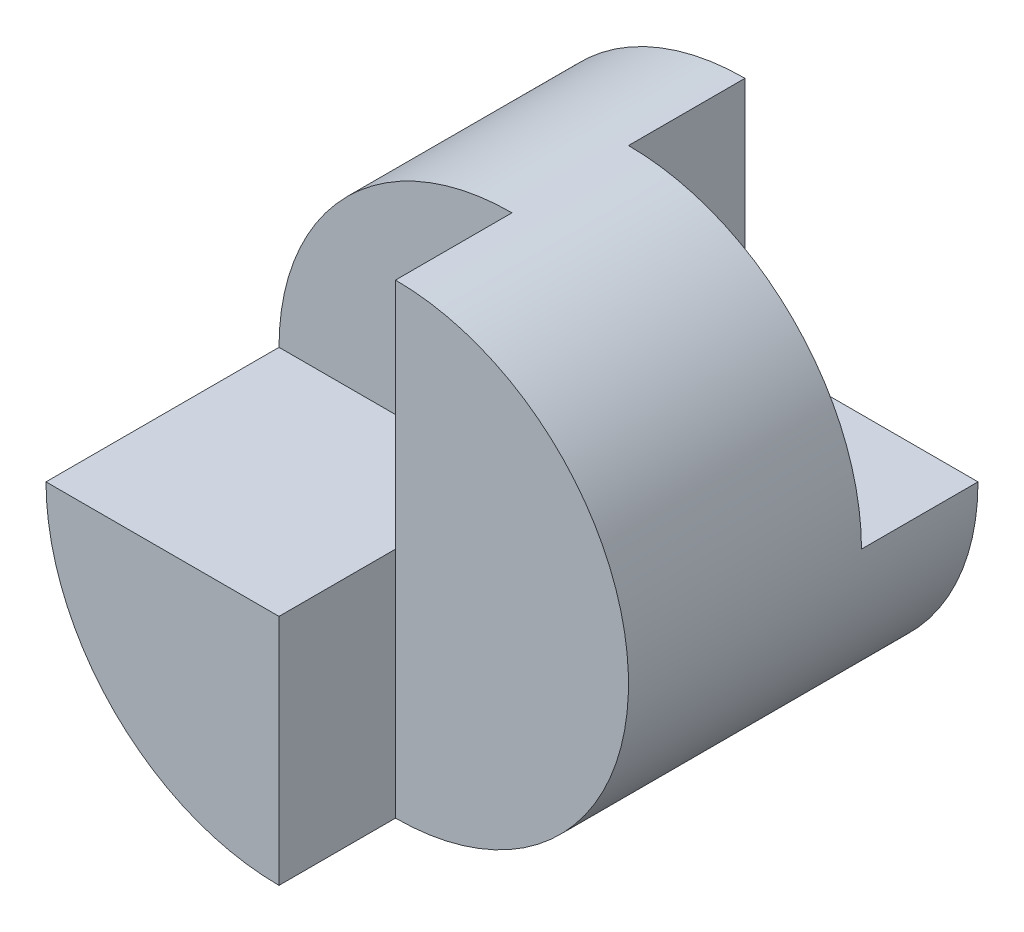
ISO-10303-21;
HEADER;
FILE_DESCRIPTION(('STEP AP214'),'2;1');
FILE_NAME('part.step','',(''),(''),'','','');
FILE_SCHEMA(('AUTOMOTIVE_DESIGN { 1 0 10303 214 1 1 1 1 }'));
ENDSEC;
DATA;
#1=APPLICATION_CONTEXT('core data for automotive mechanical design processes');
#2=APPLICATION_PROTOCOL_DEFINITION('international standard','automotive_design',2000,#1);
#3=PRODUCT_CONTEXT('',#1,'mechanical');
#4=PRODUCT('Part','Part','',(#3));
#5=PRODUCT_RELATED_PRODUCT_CATEGORY('part','',(#4));
#6=PRODUCT_DEFINITION_FORMATION('','',#4);
#7=PRODUCT_DEFINITION_CONTEXT('part definition',#1,'design');
#8=PRODUCT_DEFINITION('design','',#6,#7);
#9=PRODUCT_DEFINITION_SHAPE('','',#8);
#10=(LENGTH_UNIT() NAMED_UNIT(*) SI_UNIT(.MILLI.,.METRE.));
#11=(NAMED_UNIT(*) PLANE_ANGLE_UNIT() SI_UNIT($,.RADIAN.));
#12=(NAMED_UNIT(*) SI_UNIT($,.STERADIAN.) SOLID_ANGLE_UNIT());
#13=UNCERTAINTY_MEASURE_WITH_UNIT(LENGTH_MEASURE(1.E-05),#10,'distance_accuracy_value','');
#14=(GEOMETRIC_REPRESENTATION_CONTEXT(3) GLOBAL_UNCERTAINTY_ASSIGNED_CONTEXT((#13)) GLOBAL_UNIT_ASSIGNED_CONTEXT((#10,
#11,#12)) REPRESENTATION_CONTEXT('',''));
#15=CARTESIAN_POINT('',(0.,0.,0.));
#16=DIRECTION('',(0.,0.,1.));
#17=DIRECTION('',(1.,0.,0.));
#18=AXIS2_PLACEMENT_3D('',#15,#16,#17);
#19=CARTESIAN_POINT('',(0.,0.,40.));
#20=DIRECTION('',(0.,0.,-1.));
#21=DIRECTION('',(-1.,0.,0.));
#22=AXIS2_PLACEMENT_3D('',#19,#20,#21);
#23=PLANE('',#22);
#24=DIRECTION('',(0.,-1.,0.));
#25=VECTOR('',#24,1.);
#26=CARTESIAN_POINT('',(20.,40.,40.));
#27=LINE('',#26,#25);
#28=CARTESIAN_POINT('',(20.,20.,40.));
#29=VERTEX_POINT('',#28);
#30=CARTESIAN_POINT('',(20.,0.,40.));
#31=VERTEX_POINT('',#30);
#32=EDGE_CURVE('E216',#29,#31,#27,.T.);
#33=ORIENTED_EDGE('',*,*,#32,.F.);
#34=DIRECTION('',(1.,0.,0.));
#35=VECTOR('',#34,1.);
#36=CARTESIAN_POINT('',(0.,20.,40.));
#37=LINE('',#36,#35);
#38=CARTESIAN_POINT('',(0.,20.,40.));
#39=VERTEX_POINT('',#38);
#40=EDGE_CURVE('E127',#39,#29,#37,.T.);
#41=ORIENTED_EDGE('',*,*,#40,.F.);
#42=CARTESIAN_POINT('',(20.,20.,40.));
#43=DIRECTION('',(0.,0.,1.));
#44=DIRECTION('',(1.,0.,0.));
#45=AXIS2_PLACEMENT_3D('',#42,#43,#44);
#46=CIRCLE('',#45,20.);
#47=EDGE_CURVE('E223',#39,#31,#46,.T.);
#48=ORIENTED_EDGE('',*,*,#47,.T.);
#49=EDGE_LOOP('',(#33,#41,#48));
#50=FACE_BOUND('',#49,.T.);
#51=ADVANCED_FACE('F105',(#50),#23,.F.);
#52=CARTESIAN_POINT('',(20.,20.,0.));
#53=DIRECTION('',(0.,0.,1.));
#54=DIRECTION('',(1.,0.,0.));
#55=AXIS2_PLACEMENT_3D('',#52,#53,#54);
#56=CYLINDRICAL_SURFACE('',#55,20.);
#57=DIRECTION('',(0.,0.,-1.));
#58=VECTOR('',#57,1.);
#59=CARTESIAN_POINT('',(20.,40.,10.));
#60=LINE('',#59,#58);
#61=CARTESIAN_POINT('',(20.,40.,10.));
#62=VERTEX_POINT('',#61);
#63=CARTESIAN_POINT('',(20.,40.,0.));
#64=VERTEX_POINT('',#63);
#65=EDGE_CURVE('E168',#62,#64,#60,.T.);
#66=ORIENTED_EDGE('',*,*,#65,.T.);
#67=CARTESIAN_POINT('',(20.,20.,0.));
#68=DIRECTION('',(0.,0.,1.));
#69=DIRECTION('',(1.,0.,0.));
#70=AXIS2_PLACEMENT_3D('',#67,#68,#69);
#71=CIRCLE('',#70,20.);
#72=CARTESIAN_POINT('',(40.,20.,0.));
#73=VERTEX_POINT('',#72);
#74=EDGE_CURVE('E224',#64,#73,#71,.T.);
#75=ORIENTED_EDGE('',*,*,#74,.T.);
#76=DIRECTION('',(0.,0.,-1.));
#77=VECTOR('',#76,1.);
#78=CARTESIAN_POINT('',(40.,20.,10.));
#79=LINE('',#78,#77);
#80=CARTESIAN_POINT('',(40.,20.,10.));
#81=VERTEX_POINT('',#80);
#82=EDGE_CURVE('E120',#81,#73,#79,.T.);
#83=ORIENTED_EDGE('',*,*,#82,.F.);
#84=CARTESIAN_POINT('',(20.,20.,10.));
#85=DIRECTION('',(0.,0.,-1.));
#86=DIRECTION('',(-1.,0.,0.));
#87=AXIS2_PLACEMENT_3D('',#84,#85,#86);
#88=CIRCLE('',#87,20.);
#89=EDGE_CURVE('E183',#62,#81,#88,.T.);
#90=ORIENTED_EDGE('',*,*,#89,.F.);
#91=EDGE_LOOP('',(#66,#75,#83,#90));
#92=FACE_BOUND('',#91,.T.);
#93=DIRECTION('',(0.,0.,1.));
#94=VECTOR('',#93,1.);
#95=CARTESIAN_POINT('',(20.,40.,20.));
#96=LINE('',#95,#94);
#97=CARTESIAN_POINT('',(20.,40.,20.));
#98=VERTEX_POINT('',#97);
#99=CARTESIAN_POINT('',(20.,40.,30.));
#100=VERTEX_POINT('',#99);
#101=EDGE_CURVE('E204',#98,#100,#96,.T.);
#102=ORIENTED_EDGE('',*,*,#101,.T.);
#103=CARTESIAN_POINT('',(20.,20.,30.));
#104=DIRECTION('',(0.,0.,1.));
#105=DIRECTION('',(1.,0.,0.));
#106=AXIS2_PLACEMENT_3D('',#103,#104,#105);
#107=CIRCLE('',#106,20.);
#108=CARTESIAN_POINT('',(20.,0.,30.));
#109=VERTEX_POINT('',#108);
#110=EDGE_CURVE('E113',#100,#109,#107,.F.);
#111=ORIENTED_EDGE('',*,*,#110,.T.);
#112=DIRECTION('',(0.,0.,1.));
#113=VECTOR('',#112,1.);
#114=CARTESIAN_POINT('',(20.,0.,40.));
#115=LINE('',#114,#113);
#116=EDGE_CURVE('E209',#109,#31,#115,.T.);
#117=ORIENTED_EDGE('',*,*,#116,.T.);
#118=ORIENTED_EDGE('',*,*,#47,.F.);
#119=DIRECTION('',(0.,0.,1.));
#120=VECTOR('',#119,1.);
#121=CARTESIAN_POINT('',(0.,20.,20.));
#122=LINE('',#121,#120);
#123=CARTESIAN_POINT('',(0.,20.,20.));
#124=VERTEX_POINT('',#123);
#125=EDGE_CURVE('E210',#124,#39,#122,.T.);
#126=ORIENTED_EDGE('',*,*,#125,.F.);
#127=CARTESIAN_POINT('',(20.,20.,20.));
#128=DIRECTION('',(0.,0.,1.));
#129=DIRECTION('',(1.,0.,0.));
#130=AXIS2_PLACEMENT_3D('',#127,#128,#129);
#131=CIRCLE('',#130,20.);
#132=EDGE_CURVE('E199',#98,#124,#131,.T.);
#133=ORIENTED_EDGE('',*,*,#132,.F.);
#134=EDGE_LOOP('',(#102,#111,#117,#118,#126,#133));
#135=FACE_BOUND('',#134,.T.);
#136=ADVANCED_FACE('F186',(#92,#135),#56,.T.);
#137=CARTESIAN_POINT('',(0.,0.,0.));
#138=DIRECTION('',(0.,0.,-1.));
#139=DIRECTION('',(-1.,0.,0.));
#140=AXIS2_PLACEMENT_3D('',#137,#138,#139);
#141=PLANE('',#140);
#142=DIRECTION('',(0.,1.,0.));
#143=VECTOR('',#142,1.);
#144=CARTESIAN_POINT('',(20.,20.,0.));
#145=LINE('',#144,#143);
#146=CARTESIAN_POINT('',(20.,20.,0.));
#147=VERTEX_POINT('',#146);
#148=EDGE_CURVE('E174',#147,#64,#145,.T.);
#149=ORIENTED_EDGE('',*,*,#148,.F.);
#150=DIRECTION('',(-1.,0.,0.));
#151=VECTOR('',#150,1.);
#152=CARTESIAN_POINT('',(40.,20.,0.));
#153=LINE('',#152,#151);
#154=EDGE_CURVE('E184',#73,#147,#153,.T.);
#155=ORIENTED_EDGE('',*,*,#154,.F.);
#156=ORIENTED_EDGE('',*,*,#74,.F.);
#157=EDGE_LOOP('',(#149,#155,#156));
#158=FACE_BOUND('',#157,.T.);
#159=ADVANCED_FACE('F107',(#158),#141,.T.);
#160=CARTESIAN_POINT('',(40.,40.,30.));
#161=DIRECTION('',(0.,0.,1.));
#162=DIRECTION('',(1.,0.,0.));
#163=AXIS2_PLACEMENT_3D('',#160,#161,#162);
#164=PLANE('',#163);
#165=ORIENTED_EDGE('',*,*,#110,.F.);
#166=DIRECTION('',(0.,-1.,0.));
#167=VECTOR('',#166,1.);
#168=CARTESIAN_POINT('',(20.,40.,30.));
#169=LINE('',#168,#167);
#170=CARTESIAN_POINT('',(20.,20.,30.));
#171=VERTEX_POINT('',#170);
#172=EDGE_CURVE('E220',#100,#171,#169,.T.);
#173=ORIENTED_EDGE('',*,*,#172,.T.);
#174=EDGE_CURVE('E219',#171,#109,#169,.T.);
#175=ORIENTED_EDGE('',*,*,#174,.T.);
#176=EDGE_LOOP('',(#165,#173,#175));
#177=FACE_BOUND('',#176,.T.);
#178=ADVANCED_FACE('F232',(#177),#164,.T.);
#179=CARTESIAN_POINT('',(20.,40.,40.));
#180=DIRECTION('',(1.,0.,0.));
#181=DIRECTION('',(0.,0.,-1.));
#182=AXIS2_PLACEMENT_3D('',#179,#180,#181);
#183=PLANE('',#182);
#184=DIRECTION('',(0.,0.,-1.));
#185=VECTOR('',#184,1.);
#186=CARTESIAN_POINT('',(20.,20.,40.));
#187=LINE('',#186,#185);
#188=EDGE_CURVE('E12',#29,#171,#187,.T.);
#189=ORIENTED_EDGE('',*,*,#188,.F.);
#190=ORIENTED_EDGE('',*,*,#32,.T.);
#191=ORIENTED_EDGE('',*,*,#116,.F.);
#192=ORIENTED_EDGE('',*,*,#174,.F.);
#193=EDGE_LOOP('',(#189,#190,#191,#192));
#194=FACE_BOUND('',#193,.T.);
#195=ADVANCED_FACE('F235',(#194),#183,.T.);
#196=CARTESIAN_POINT('',(20.,20.,20.));
#197=DIRECTION('',(1.,0.,0.));
#198=DIRECTION('',(0.,1.,0.));
#199=AXIS2_PLACEMENT_3D('',#196,#197,#198);
#200=PLANE('',#199);
#201=ORIENTED_EDGE('',*,*,#172,.F.);
#202=ORIENTED_EDGE('',*,*,#101,.F.);
#203=DIRECTION('',(0.,1.,0.));
#204=VECTOR('',#203,1.);
#205=CARTESIAN_POINT('',(20.,20.,20.));
#206=LINE('',#205,#204);
#207=CARTESIAN_POINT('',(20.,20.,20.));
#208=VERTEX_POINT('',#207);
#209=EDGE_CURVE('E196',#208,#98,#206,.T.);
#210=ORIENTED_EDGE('',*,*,#209,.F.);
#211=DIRECTION('',(0.,0.,1.));
#212=VECTOR('',#211,1.);
#213=CARTESIAN_POINT('',(20.,20.,20.));
#214=LINE('',#213,#212);
#215=EDGE_CURVE('E206',#208,#171,#214,.T.);
#216=ORIENTED_EDGE('',*,*,#215,.T.);
#217=EDGE_LOOP('',(#201,#202,#210,#216));
#218=FACE_BOUND('',#217,.T.);
#219=ADVANCED_FACE('F245',(#218),#200,.F.);
#220=CARTESIAN_POINT('',(0.,20.,20.));
#221=DIRECTION('',(0.,-1.,0.));
#222=DIRECTION('',(1.,0.,0.));
#223=AXIS2_PLACEMENT_3D('',#220,#221,#222);
#224=PLANE('',#223);
#225=ORIENTED_EDGE('',*,*,#40,.T.);
#226=ORIENTED_EDGE('',*,*,#188,.T.);
#227=ORIENTED_EDGE('',*,*,#215,.F.);
#228=DIRECTION('',(1.,0.,0.));
#229=VECTOR('',#228,1.);
#230=CARTESIAN_POINT('',(0.,20.,20.));
#231=LINE('',#230,#229);
#232=EDGE_CURVE('E201',#124,#208,#231,.T.);
#233=ORIENTED_EDGE('',*,*,#232,.F.);
#234=ORIENTED_EDGE('',*,*,#125,.T.);
#235=EDGE_LOOP('',(#225,#226,#227,#233,#234));
#236=FACE_BOUND('',#235,.T.);
#237=ADVANCED_FACE('F240',(#236),#224,.F.);
#238=CARTESIAN_POINT('',(20.,20.,20.));
#239=DIRECTION('',(0.,0.,1.));
#240=DIRECTION('',(1.,0.,0.));
#241=AXIS2_PLACEMENT_3D('',#238,#239,#240);
#242=PLANE('',#241);
#243=ORIENTED_EDGE('',*,*,#209,.T.);
#244=ORIENTED_EDGE('',*,*,#132,.T.);
#245=ORIENTED_EDGE('',*,*,#232,.T.);
#246=EDGE_LOOP('',(#243,#244,#245));
#247=FACE_BOUND('',#246,.T.);
#248=ADVANCED_FACE('F243',(#247),#242,.T.);
#249=CARTESIAN_POINT('',(20.,20.,10.));
#250=DIRECTION('',(-1.,0.,0.));
#251=DIRECTION('',(0.,0.,1.));
#252=AXIS2_PLACEMENT_3D('',#249,#250,#251);
#253=PLANE('',#252);
#254=ORIENTED_EDGE('',*,*,#148,.T.);
#255=ORIENTED_EDGE('',*,*,#65,.F.);
#256=DIRECTION('',(0.,1.,0.));
#257=VECTOR('',#256,1.);
#258=CARTESIAN_POINT('',(20.,20.,10.));
#259=LINE('',#258,#257);
#260=CARTESIAN_POINT('',(20.,20.,10.));
#261=VERTEX_POINT('',#260);
#262=EDGE_CURVE('E171',#261,#62,#259,.T.);
#263=ORIENTED_EDGE('',*,*,#262,.F.);
#264=DIRECTION('',(0.,0.,-1.));
#265=VECTOR('',#264,1.);
#266=CARTESIAN_POINT('',(20.,20.,10.));
#267=LINE('',#266,#265);
#268=EDGE_CURVE('E193',#261,#147,#267,.T.);
#269=ORIENTED_EDGE('',*,*,#268,.T.);
#270=EDGE_LOOP('',(#254,#255,#263,#269));
#271=FACE_BOUND('',#270,.T.);
#272=ADVANCED_FACE('F170',(#271),#253,.F.);
#273=CARTESIAN_POINT('',(40.,20.,10.));
#274=DIRECTION('',(0.,-1.,0.));
#275=DIRECTION('',(0.,0.,-1.));
#276=AXIS2_PLACEMENT_3D('',#273,#274,#275);
#277=PLANE('',#276);
#278=ORIENTED_EDGE('',*,*,#154,.T.);
#279=ORIENTED_EDGE('',*,*,#268,.F.);
#280=DIRECTION('',(-1.,0.,0.));
#281=VECTOR('',#280,1.);
#282=CARTESIAN_POINT('',(40.,20.,10.));
#283=LINE('',#282,#281);
#284=EDGE_CURVE('E179',#81,#261,#283,.T.);
#285=ORIENTED_EDGE('',*,*,#284,.F.);
#286=ORIENTED_EDGE('',*,*,#82,.T.);
#287=EDGE_LOOP('',(#278,#279,#285,#286));
#288=FACE_BOUND('',#287,.T.);
#289=ADVANCED_FACE('F267',(#288),#277,.F.);
#290=CARTESIAN_POINT('',(20.,20.,10.));
#291=DIRECTION('',(0.,0.,-1.));
#292=DIRECTION('',(-1.,0.,0.));
#293=AXIS2_PLACEMENT_3D('',#290,#291,#292);
#294=PLANE('',#293);
#295=ORIENTED_EDGE('',*,*,#262,.T.);
#296=ORIENTED_EDGE('',*,*,#89,.T.);
#297=ORIENTED_EDGE('',*,*,#284,.T.);
#298=EDGE_LOOP('',(#295,#296,#297));
#299=FACE_BOUND('',#298,.T.);
#300=ADVANCED_FACE('F182',(#299),#294,.T.);
#301=CLOSED_SHELL('',(#51,#136,#159,#178,#195,#219,#237,#248,#272,#289,#300));
#302=MANIFOLD_SOLID_BREP('B2',#301);
#303=ADVANCED_BREP_SHAPE_REPRESENTATION('',(#18,#302),#14);
#304=SHAPE_DEFINITION_REPRESENTATION(#9,#303);
ENDSEC;
END-ISO-10303-21;
